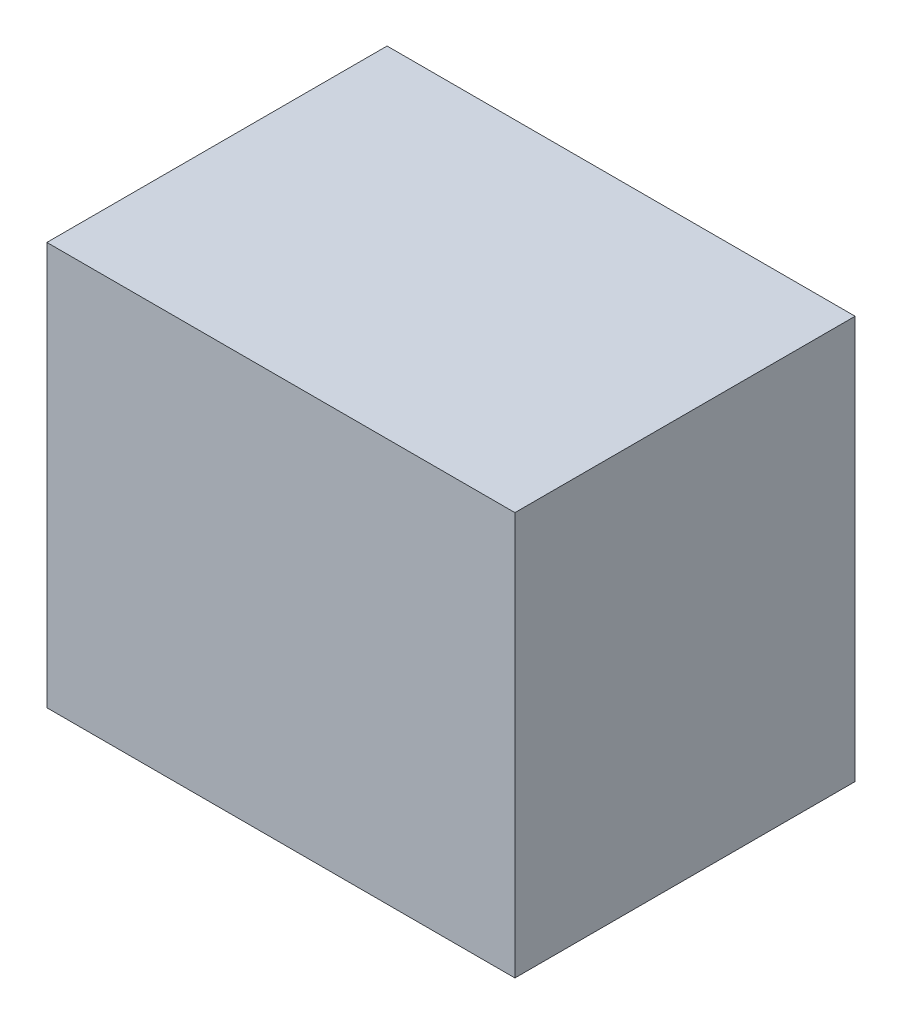
ISO-10303-21;
HEADER;
FILE_DESCRIPTION(('STEP AP214'),'2;1');
FILE_NAME('part.step','',(''),(''),'','','');
FILE_SCHEMA(('AUTOMOTIVE_DESIGN { 1 0 10303 214 1 1 1 1 }'));
ENDSEC;
DATA;
#1=APPLICATION_CONTEXT('core data for automotive mechanical design processes');
#2=APPLICATION_PROTOCOL_DEFINITION('international standard','automotive_design',2000,#1);
#3=PRODUCT_CONTEXT('',#1,'mechanical');
#4=PRODUCT('Part','Part','',(#3));
#5=PRODUCT_RELATED_PRODUCT_CATEGORY('part','',(#4));
#6=PRODUCT_DEFINITION_FORMATION('','',#4);
#7=PRODUCT_DEFINITION_CONTEXT('part definition',#1,'design');
#8=PRODUCT_DEFINITION('design','',#6,#7);
#9=PRODUCT_DEFINITION_SHAPE('','',#8);
#10=(LENGTH_UNIT() NAMED_UNIT(*) SI_UNIT(.MILLI.,.METRE.));
#11=(NAMED_UNIT(*) PLANE_ANGLE_UNIT() SI_UNIT($,.RADIAN.));
#12=(NAMED_UNIT(*) SI_UNIT($,.STERADIAN.) SOLID_ANGLE_UNIT());
#13=UNCERTAINTY_MEASURE_WITH_UNIT(LENGTH_MEASURE(1.E-05),#10,'distance_accuracy_value','');
#14=(GEOMETRIC_REPRESENTATION_CONTEXT(3) GLOBAL_UNCERTAINTY_ASSIGNED_CONTEXT((#13)) GLOBAL_UNIT_ASSIGNED_CONTEXT((#10,
#11,#12)) REPRESENTATION_CONTEXT('',''));
#15=CARTESIAN_POINT('',(0.,0.,0.));
#16=DIRECTION('',(0.,0.,1.));
#17=DIRECTION('',(1.,0.,0.));
#18=AXIS2_PLACEMENT_3D('',#15,#16,#17);
#19=CARTESIAN_POINT('',(0.,46.5,0.));
#20=DIRECTION('',(1.,0.,0.));
#21=DIRECTION('',(0.,0.,-1.));
#22=AXIS2_PLACEMENT_3D('',#19,#20,#21);
#23=PLANE('',#22);
#24=DIRECTION('',(0.,0.,1.));
#25=VECTOR('',#24,1.);
#26=CARTESIAN_POINT('',(0.,0.,0.));
#27=LINE('',#26,#25);
#28=CARTESIAN_POINT('',(0.,0.,-39.25));
#29=VERTEX_POINT('',#28);
#30=CARTESIAN_POINT('',(0.,0.,0.));
#31=VERTEX_POINT('',#30);
#32=EDGE_CURVE('E96',#29,#31,#27,.T.);
#33=ORIENTED_EDGE('',*,*,#32,.T.);
#34=DIRECTION('',(0.,-1.,0.));
#35=VECTOR('',#34,1.);
#36=CARTESIAN_POINT('',(0.,46.5,0.));
#37=LINE('',#36,#35);
#38=CARTESIAN_POINT('',(0.,46.5,0.));
#39=VERTEX_POINT('',#38);
#40=EDGE_CURVE('E11',#39,#31,#37,.T.);
#41=ORIENTED_EDGE('',*,*,#40,.F.);
#42=DIRECTION('',(0.,0.,1.));
#43=VECTOR('',#42,1.);
#44=CARTESIAN_POINT('',(0.,46.5,0.));
#45=LINE('',#44,#43);
#46=CARTESIAN_POINT('',(0.,46.5,-39.25));
#47=VERTEX_POINT('',#46);
#48=EDGE_CURVE('E84',#47,#39,#45,.T.);
#49=ORIENTED_EDGE('',*,*,#48,.F.);
#50=DIRECTION('',(0.,-1.,0.));
#51=VECTOR('',#50,1.);
#52=CARTESIAN_POINT('',(0.,46.5,-39.25));
#53=LINE('',#52,#51);
#54=EDGE_CURVE('E92',#47,#29,#53,.T.);
#55=ORIENTED_EDGE('',*,*,#54,.T.);
#56=EDGE_LOOP('',(#33,#41,#49,#55));
#57=FACE_BOUND('',#56,.T.);
#58=ADVANCED_FACE('F33',(#57),#23,.F.);
#59=CARTESIAN_POINT('',(0.,46.5,0.));
#60=DIRECTION('',(0.,0.,-1.));
#61=DIRECTION('',(-1.,0.,0.));
#62=AXIS2_PLACEMENT_3D('',#59,#60,#61);
#63=PLANE('',#62);
#64=DIRECTION('',(1.,0.,0.));
#65=VECTOR('',#64,1.);
#66=CARTESIAN_POINT('',(0.,0.,0.));
#67=LINE('',#66,#65);
#68=CARTESIAN_POINT('',(54.,0.,0.));
#69=VERTEX_POINT('',#68);
#70=EDGE_CURVE('E88',#31,#69,#67,.T.);
#71=ORIENTED_EDGE('',*,*,#70,.T.);
#72=DIRECTION('',(0.,-1.,0.));
#73=VECTOR('',#72,1.);
#74=CARTESIAN_POINT('',(54.,46.5,0.));
#75=LINE('',#74,#73);
#76=CARTESIAN_POINT('',(54.,46.5,0.));
#77=VERTEX_POINT('',#76);
#78=EDGE_CURVE('E41',#77,#69,#75,.T.);
#79=ORIENTED_EDGE('',*,*,#78,.F.);
#80=DIRECTION('',(1.,0.,0.));
#81=VECTOR('',#80,1.);
#82=CARTESIAN_POINT('',(0.,46.5,0.));
#83=LINE('',#82,#81);
#84=EDGE_CURVE('E79',#39,#77,#83,.T.);
#85=ORIENTED_EDGE('',*,*,#84,.F.);
#86=ORIENTED_EDGE('',*,*,#40,.T.);
#87=EDGE_LOOP('',(#71,#79,#85,#86));
#88=FACE_BOUND('',#87,.T.);
#89=ADVANCED_FACE('F87',(#88),#63,.F.);
#90=CARTESIAN_POINT('',(54.,46.5,0.));
#91=DIRECTION('',(-1.,0.,0.));
#92=DIRECTION('',(0.,0.,1.));
#93=AXIS2_PLACEMENT_3D('',#90,#91,#92);
#94=PLANE('',#93);
#95=DIRECTION('',(0.,0.,-1.));
#96=VECTOR('',#95,1.);
#97=CARTESIAN_POINT('',(54.,0.,0.));
#98=LINE('',#97,#96);
#99=CARTESIAN_POINT('',(54.,0.,-39.25));
#100=VERTEX_POINT('',#99);
#101=EDGE_CURVE('E66',#69,#100,#98,.T.);
#102=ORIENTED_EDGE('',*,*,#101,.T.);
#103=DIRECTION('',(0.,-1.,0.));
#104=VECTOR('',#103,1.);
#105=CARTESIAN_POINT('',(54.,46.5,-39.25));
#106=LINE('',#105,#104);
#107=CARTESIAN_POINT('',(54.,46.5,-39.25));
#108=VERTEX_POINT('',#107);
#109=EDGE_CURVE('E89',#108,#100,#106,.T.);
#110=ORIENTED_EDGE('',*,*,#109,.F.);
#111=DIRECTION('',(0.,0.,-1.));
#112=VECTOR('',#111,1.);
#113=CARTESIAN_POINT('',(54.,46.5,0.));
#114=LINE('',#113,#112);
#115=EDGE_CURVE('E82',#77,#108,#114,.T.);
#116=ORIENTED_EDGE('',*,*,#115,.F.);
#117=ORIENTED_EDGE('',*,*,#78,.T.);
#118=EDGE_LOOP('',(#102,#110,#116,#117));
#119=FACE_BOUND('',#118,.T.);
#120=ADVANCED_FACE('F90',(#119),#94,.F.);
#121=CARTESIAN_POINT('',(0.,46.5,-39.25));
#122=DIRECTION('',(0.,0.,1.));
#123=DIRECTION('',(1.,0.,0.));
#124=AXIS2_PLACEMENT_3D('',#121,#122,#123);
#125=PLANE('',#124);
#126=DIRECTION('',(-1.,0.,0.));
#127=VECTOR('',#126,1.);
#128=CARTESIAN_POINT('',(0.,0.,-39.25));
#129=LINE('',#128,#127);
#130=EDGE_CURVE('E72',#100,#29,#129,.T.);
#131=ORIENTED_EDGE('',*,*,#130,.T.);
#132=ORIENTED_EDGE('',*,*,#54,.F.);
#133=DIRECTION('',(-1.,0.,0.));
#134=VECTOR('',#133,1.);
#135=CARTESIAN_POINT('',(0.,46.5,-39.25));
#136=LINE('',#135,#134);
#137=EDGE_CURVE('E49',#108,#47,#136,.T.);
#138=ORIENTED_EDGE('',*,*,#137,.F.);
#139=ORIENTED_EDGE('',*,*,#109,.T.);
#140=EDGE_LOOP('',(#131,#132,#138,#139));
#141=FACE_BOUND('',#140,.T.);
#142=ADVANCED_FACE('F103',(#141),#125,.F.);
#143=CARTESIAN_POINT('',(0.,46.5,0.));
#144=DIRECTION('',(0.,-1.,0.));
#145=DIRECTION('',(0.,0.,-1.));
#146=AXIS2_PLACEMENT_3D('',#143,#144,#145);
#147=PLANE('',#146);
#148=ORIENTED_EDGE('',*,*,#48,.T.);
#149=ORIENTED_EDGE('',*,*,#84,.T.);
#150=ORIENTED_EDGE('',*,*,#115,.T.);
#151=ORIENTED_EDGE('',*,*,#137,.T.);
#152=EDGE_LOOP('',(#148,#149,#150,#151));
#153=FACE_BOUND('',#152,.T.);
#154=ADVANCED_FACE('F80',(#153),#147,.F.);
#155=CARTESIAN_POINT('',(0.,0.,0.));
#156=DIRECTION('',(0.,-1.,0.));
#157=DIRECTION('',(0.,0.,-1.));
#158=AXIS2_PLACEMENT_3D('',#155,#156,#157);
#159=PLANE('',#158);
#160=ORIENTED_EDGE('',*,*,#32,.F.);
#161=ORIENTED_EDGE('',*,*,#130,.F.);
#162=ORIENTED_EDGE('',*,*,#101,.F.);
#163=ORIENTED_EDGE('',*,*,#70,.F.);
#164=EDGE_LOOP('',(#160,#161,#162,#163));
#165=FACE_BOUND('',#164,.T.);
#166=ADVANCED_FACE('F106',(#165),#159,.T.);
#167=CLOSED_SHELL('',(#58,#89,#120,#142,#154,#166));
#168=MANIFOLD_SOLID_BREP('B2',#167);
#169=ADVANCED_BREP_SHAPE_REPRESENTATION('',(#18,#168),#14);
#170=SHAPE_DEFINITION_REPRESENTATION(#9,#169);
ENDSEC;
END-ISO-10303-21;
